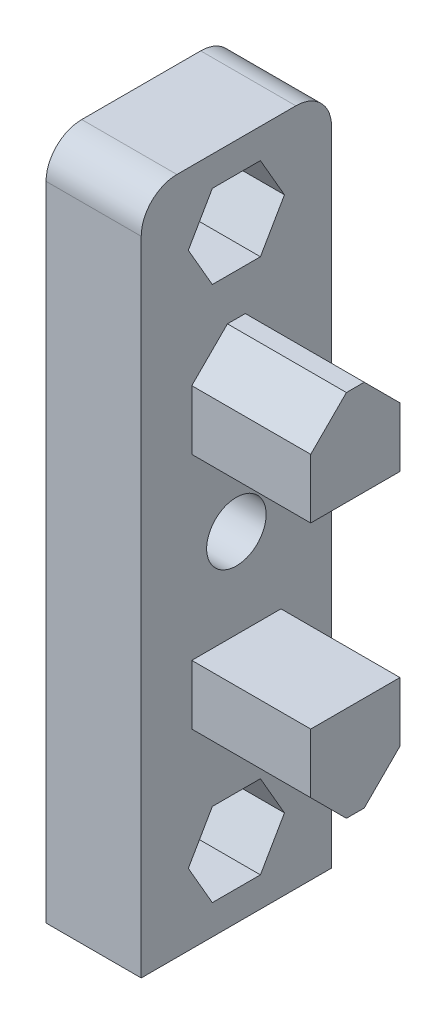
ISO-10303-21;
HEADER;
FILE_DESCRIPTION(('STEP AP214'),'2;1');
FILE_NAME('part.step','',(''),(''),'','','');
FILE_SCHEMA(('AUTOMOTIVE_DESIGN { 1 0 10303 214 1 1 1 1 }'));
ENDSEC;
DATA;
#1=APPLICATION_CONTEXT('core data for automotive mechanical design processes');
#2=APPLICATION_PROTOCOL_DEFINITION('international standard','automotive_design',2000,#1);
#3=PRODUCT_CONTEXT('',#1,'mechanical');
#4=PRODUCT('Part','Part','',(#3));
#5=PRODUCT_RELATED_PRODUCT_CATEGORY('part','',(#4));
#6=PRODUCT_DEFINITION_FORMATION('','',#4);
#7=PRODUCT_DEFINITION_CONTEXT('part definition',#1,'design');
#8=PRODUCT_DEFINITION('design','',#6,#7);
#9=PRODUCT_DEFINITION_SHAPE('','',#8);
#10=(LENGTH_UNIT() NAMED_UNIT(*) SI_UNIT(.MILLI.,.METRE.));
#11=(NAMED_UNIT(*) PLANE_ANGLE_UNIT() SI_UNIT($,.RADIAN.));
#12=(NAMED_UNIT(*) SI_UNIT($,.STERADIAN.) SOLID_ANGLE_UNIT());
#13=UNCERTAINTY_MEASURE_WITH_UNIT(LENGTH_MEASURE(1.E-05),#10,'distance_accuracy_value','');
#14=(GEOMETRIC_REPRESENTATION_CONTEXT(3) GLOBAL_UNCERTAINTY_ASSIGNED_CONTEXT((#13)) GLOBAL_UNIT_ASSIGNED_CONTEXT((#10,
#11,#12)) REPRESENTATION_CONTEXT('',''));
#15=CARTESIAN_POINT('',(0.,0.,0.));
#16=DIRECTION('',(0.,0.,1.));
#17=DIRECTION('',(1.,0.,0.));
#18=AXIS2_PLACEMENT_3D('',#15,#16,#17);
#19=CARTESIAN_POINT('',(8.,0.,0.));
#20=DIRECTION('',(1.,0.,0.));
#21=DIRECTION('',(0.,0.,-1.));
#22=AXIS2_PLACEMENT_3D('',#19,#20,#21);
#23=PLANE('',#22);
#24=CARTESIAN_POINT('',(8.,-14.25,0.));
#25=DIRECTION('',(1.,0.,0.));
#26=DIRECTION('',(0.,0.,-1.));
#27=AXIS2_PLACEMENT_3D('',#24,#25,#26);
#28=CIRCLE('',#27,2.5);
#29=CARTESIAN_POINT('',(8.,-14.25,-2.5));
#30=VERTEX_POINT('',#29);
#31=EDGE_CURVE('E895',#30,#30,#28,.T.);
#32=ORIENTED_EDGE('',*,*,#31,.F.);
#33=EDGE_LOOP('',(#32));
#34=FACE_BOUND('',#33,.T.);
#35=DIRECTION('',(0.,1.,0.));
#36=VECTOR('',#35,1.);
#37=CARTESIAN_POINT('',(8.,14.25,-8.));
#38=LINE('',#37,#36);
#39=CARTESIAN_POINT('',(8.,-42.75,-8.));
#40=VERTEX_POINT('',#39);
#41=CARTESIAN_POINT('',(8.,11.25,-8.));
#42=VERTEX_POINT('',#41);
#43=EDGE_CURVE('E433',#40,#42,#38,.T.);
#44=ORIENTED_EDGE('',*,*,#43,.T.);
#45=CARTESIAN_POINT('',(8.,11.25,-5.));
#46=DIRECTION('',(1.,0.,0.));
#47=DIRECTION('',(0.,0.,-1.));
#48=AXIS2_PLACEMENT_3D('',#45,#46,#47);
#49=CIRCLE('',#48,3.);
#50=CARTESIAN_POINT('',(8.,14.25,-5.));
#51=VERTEX_POINT('',#50);
#52=EDGE_CURVE('E41',#42,#51,#49,.T.);
#53=ORIENTED_EDGE('',*,*,#52,.T.);
#54=DIRECTION('',(0.,0.,1.));
#55=VECTOR('',#54,1.);
#56=CARTESIAN_POINT('',(8.,14.25,8.));
#57=LINE('',#56,#55);
#58=CARTESIAN_POINT('',(8.,14.25,5.));
#59=VERTEX_POINT('',#58);
#60=EDGE_CURVE('E435',#51,#59,#57,.T.);
#61=ORIENTED_EDGE('',*,*,#60,.T.);
#62=CARTESIAN_POINT('',(8.,11.25,5.));
#63=DIRECTION('',(1.,0.,0.));
#64=DIRECTION('',(0.,0.,-1.));
#65=AXIS2_PLACEMENT_3D('',#62,#63,#64);
#66=CIRCLE('',#65,3.);
#67=CARTESIAN_POINT('',(8.,11.25,8.));
#68=VERTEX_POINT('',#67);
#69=EDGE_CURVE('E48',#59,#68,#66,.T.);
#70=ORIENTED_EDGE('',*,*,#69,.T.);
#71=DIRECTION('',(0.,-1.,0.));
#72=VECTOR('',#71,1.);
#73=CARTESIAN_POINT('',(8.,14.25,8.));
#74=LINE('',#73,#72);
#75=CARTESIAN_POINT('',(8.,-42.75,8.));
#76=VERTEX_POINT('',#75);
#77=EDGE_CURVE('E438',#68,#76,#74,.T.);
#78=ORIENTED_EDGE('',*,*,#77,.T.);
#79=DIRECTION('',(0.,0.,1.));
#80=VECTOR('',#79,1.);
#81=CARTESIAN_POINT('',(8.,-42.75,8.));
#82=LINE('',#81,#80);
#83=EDGE_CURVE('E322',#40,#76,#82,.T.);
#84=ORIENTED_EDGE('',*,*,#83,.F.);
#85=EDGE_LOOP('',(#44,#53,#61,#70,#78,#84));
#86=FACE_BOUND('',#85,.T.);
#87=DIRECTION('',(0.,0.866025403784439,-0.5));
#88=VECTOR('',#87,1.);
#89=CARTESIAN_POINT('',(8.,4.74999999999999,-2.02072594216369));
#90=LINE('',#89,#88);
#91=CARTESIAN_POINT('',(8.,4.74999999999999,-2.02072594216369));
#92=VERTEX_POINT('',#91);
#93=CARTESIAN_POINT('',(8.,8.25,-4.04145188432738));
#94=VERTEX_POINT('',#93);
#95=EDGE_CURVE('E382',#92,#94,#90,.T.);
#96=ORIENTED_EDGE('',*,*,#95,.F.);
#97=DIRECTION('',(0.,0.,-1.));
#98=VECTOR('',#97,1.);
#99=CARTESIAN_POINT('',(8.,4.75,2.02072594216369));
#100=LINE('',#99,#98);
#101=CARTESIAN_POINT('',(8.,4.75,2.02072594216369));
#102=VERTEX_POINT('',#101);
#103=EDGE_CURVE('E389',#102,#92,#100,.T.);
#104=ORIENTED_EDGE('',*,*,#103,.F.);
#105=DIRECTION('',(0.,-0.866025403784438,-0.5));
#106=VECTOR('',#105,1.);
#107=CARTESIAN_POINT('',(8.,8.24999999999999,4.04145188432738));
#108=LINE('',#107,#106);
#109=CARTESIAN_POINT('',(8.,8.24999999999999,4.04145188432738));
#110=VERTEX_POINT('',#109);
#111=EDGE_CURVE('E415',#110,#102,#108,.T.);
#112=ORIENTED_EDGE('',*,*,#111,.F.);
#113=DIRECTION('',(0.,-0.866025403784439,0.5));
#114=VECTOR('',#113,1.);
#115=CARTESIAN_POINT('',(8.,11.75,2.02072594216369));
#116=LINE('',#115,#114);
#117=CARTESIAN_POINT('',(8.,11.75,2.02072594216369));
#118=VERTEX_POINT('',#117);
#119=EDGE_CURVE('E412',#118,#110,#116,.T.);
#120=ORIENTED_EDGE('',*,*,#119,.F.);
#121=DIRECTION('',(0.,0.,1.));
#122=VECTOR('',#121,1.);
#123=CARTESIAN_POINT('',(8.,11.75,-2.02072594216369));
#124=LINE('',#123,#122);
#125=CARTESIAN_POINT('',(8.,11.75,-2.02072594216369));
#126=VERTEX_POINT('',#125);
#127=EDGE_CURVE('E409',#126,#118,#124,.T.);
#128=ORIENTED_EDGE('',*,*,#127,.F.);
#129=DIRECTION('',(0.,0.866025403784438,0.5));
#130=VECTOR('',#129,1.);
#131=CARTESIAN_POINT('',(8.,8.25,-4.04145188432738));
#132=LINE('',#131,#130);
#133=EDGE_CURVE('E406',#94,#126,#132,.T.);
#134=ORIENTED_EDGE('',*,*,#133,.F.);
#135=EDGE_LOOP('',(#96,#104,#112,#120,#128,#134));
#136=FACE_BOUND('',#135,.T.);
#137=DIRECTION('',(0.,0.,1.));
#138=VECTOR('',#137,1.);
#139=CARTESIAN_POINT('',(8.,1.24999999999999,3.75));
#140=LINE('',#139,#138);
#141=CARTESIAN_POINT('',(8.,1.24999999999999,-0.750000000000002));
#142=VERTEX_POINT('',#141);
#143=CARTESIAN_POINT('',(8.,1.24999999999999,0.749999999999996));
#144=VERTEX_POINT('',#143);
#145=EDGE_CURVE('E367',#142,#144,#140,.T.);
#146=ORIENTED_EDGE('',*,*,#145,.F.);
#147=DIRECTION('',(0.,0.707106781186549,0.707106781186546));
#148=VECTOR('',#147,1.);
#149=CARTESIAN_POINT('',(8.,1.24999999999999,-0.750000000000002));
#150=LINE('',#149,#148);
#151=CARTESIAN_POINT('',(8.,-1.75000000000002,-3.75));
#152=VERTEX_POINT('',#151);
#153=EDGE_CURVE('E459',#142,#152,#150,.F.);
#154=ORIENTED_EDGE('',*,*,#153,.T.);
#155=DIRECTION('',(0.,1.,0.));
#156=VECTOR('',#155,1.);
#157=CARTESIAN_POINT('',(8.,1.24999999999999,-3.75));
#158=LINE('',#157,#156);
#159=CARTESIAN_POINT('',(8.,-6.75000000000001,-3.75));
#160=VERTEX_POINT('',#159);
#161=EDGE_CURVE('E352',#160,#152,#158,.T.);
#162=ORIENTED_EDGE('',*,*,#161,.F.);
#163=DIRECTION('',(0.,0.,-1.));
#164=VECTOR('',#163,1.);
#165=CARTESIAN_POINT('',(8.,-6.75000000000001,3.75));
#166=LINE('',#165,#164);
#167=CARTESIAN_POINT('',(8.,-6.75000000000001,3.75));
#168=VERTEX_POINT('',#167);
#169=EDGE_CURVE('E357',#168,#160,#166,.T.);
#170=ORIENTED_EDGE('',*,*,#169,.F.);
#171=DIRECTION('',(0.,-1.,0.));
#172=VECTOR('',#171,1.);
#173=CARTESIAN_POINT('',(8.,1.24999999999999,3.75));
#174=LINE('',#173,#172);
#175=CARTESIAN_POINT('',(8.,-1.75,3.75));
#176=VERTEX_POINT('',#175);
#177=EDGE_CURVE('E370',#176,#168,#174,.T.);
#178=ORIENTED_EDGE('',*,*,#177,.F.);
#179=DIRECTION('',(0.,-0.707106781186547,0.707106781186548));
#180=VECTOR('',#179,1.);
#181=CARTESIAN_POINT('',(8.,-1.75,3.75));
#182=LINE('',#181,#180);
#183=EDGE_CURVE('E461',#176,#144,#182,.F.);
#184=ORIENTED_EDGE('',*,*,#183,.T.);
#185=EDGE_LOOP('',(#146,#154,#162,#170,#178,#184));
#186=FACE_BOUND('',#185,.T.);
#187=DIRECTION('',(0.,-0.866025403784439,-0.5));
#188=VECTOR('',#187,1.);
#189=CARTESIAN_POINT('',(8.,-33.25,-2.02072594216369));
#190=LINE('',#189,#188);
#191=CARTESIAN_POINT('',(8.,-33.25,-2.02072594216369));
#192=VERTEX_POINT('',#191);
#193=CARTESIAN_POINT('',(8.,-36.75,-4.04145188432738));
#194=VERTEX_POINT('',#193);
#195=EDGE_CURVE('E276',#192,#194,#190,.T.);
#196=ORIENTED_EDGE('',*,*,#195,.T.);
#197=DIRECTION('',(0.,-0.866025403784438,0.5));
#198=VECTOR('',#197,1.);
#199=CARTESIAN_POINT('',(8.,-36.75,-4.04145188432738));
#200=LINE('',#199,#198);
#201=CARTESIAN_POINT('',(8.,-40.25,-2.02072594216369));
#202=VERTEX_POINT('',#201);
#203=EDGE_CURVE('E296',#194,#202,#200,.T.);
#204=ORIENTED_EDGE('',*,*,#203,.T.);
#205=DIRECTION('',(0.,0.,1.));
#206=VECTOR('',#205,1.);
#207=CARTESIAN_POINT('',(8.,-40.25,-2.02072594216369));
#208=LINE('',#207,#206);
#209=CARTESIAN_POINT('',(8.,-40.25,2.02072594216369));
#210=VERTEX_POINT('',#209);
#211=EDGE_CURVE('E299',#202,#210,#208,.T.);
#212=ORIENTED_EDGE('',*,*,#211,.T.);
#213=DIRECTION('',(0.,0.866025403784439,0.5));
#214=VECTOR('',#213,1.);
#215=CARTESIAN_POINT('',(8.,-40.25,2.02072594216369));
#216=LINE('',#215,#214);
#217=CARTESIAN_POINT('',(8.,-36.75,4.04145188432738));
#218=VERTEX_POINT('',#217);
#219=EDGE_CURVE('E302',#210,#218,#216,.T.);
#220=ORIENTED_EDGE('',*,*,#219,.T.);
#221=DIRECTION('',(0.,0.866025403784438,-0.5));
#222=VECTOR('',#221,1.);
#223=CARTESIAN_POINT('',(8.,-36.75,4.04145188432738));
#224=LINE('',#223,#222);
#225=CARTESIAN_POINT('',(8.,-33.25,2.02072594216369));
#226=VERTEX_POINT('',#225);
#227=EDGE_CURVE('E305',#218,#226,#224,.T.);
#228=ORIENTED_EDGE('',*,*,#227,.T.);
#229=DIRECTION('',(0.,0.,-1.));
#230=VECTOR('',#229,1.);
#231=CARTESIAN_POINT('',(8.,-33.25,2.02072594216369));
#232=LINE('',#231,#230);
#233=EDGE_CURVE('E283',#226,#192,#232,.T.);
#234=ORIENTED_EDGE('',*,*,#233,.T.);
#235=EDGE_LOOP('',(#196,#204,#212,#220,#228,#234));
#236=FACE_BOUND('',#235,.T.);
#237=DIRECTION('',(0.,0.,1.));
#238=VECTOR('',#237,1.);
#239=CARTESIAN_POINT('',(8.,-29.75,3.75));
#240=LINE('',#239,#238);
#241=CARTESIAN_POINT('',(8.,-29.75,-0.750000000000002));
#242=VERTEX_POINT('',#241);
#243=CARTESIAN_POINT('',(8.,-29.75,0.749999999999996));
#244=VERTEX_POINT('',#243);
#245=EDGE_CURVE('E265',#242,#244,#240,.T.);
#246=ORIENTED_EDGE('',*,*,#245,.T.);
#247=DIRECTION('',(0.,0.707106781186547,0.707106781186548));
#248=VECTOR('',#247,1.);
#249=CARTESIAN_POINT('',(8.,-26.75,3.75));
#250=LINE('',#249,#248);
#251=CARTESIAN_POINT('',(8.,-26.75,3.75));
#252=VERTEX_POINT('',#251);
#253=EDGE_CURVE('E349',#252,#244,#250,.F.);
#254=ORIENTED_EDGE('',*,*,#253,.F.);
#255=DIRECTION('',(0.,1.,0.));
#256=VECTOR('',#255,1.);
#257=CARTESIAN_POINT('',(8.,-29.75,3.75));
#258=LINE('',#257,#256);
#259=CARTESIAN_POINT('',(8.,-21.75,3.75));
#260=VERTEX_POINT('',#259);
#261=EDGE_CURVE('E269',#252,#260,#258,.T.);
#262=ORIENTED_EDGE('',*,*,#261,.T.);
#263=DIRECTION('',(0.,0.,-1.));
#264=VECTOR('',#263,1.);
#265=CARTESIAN_POINT('',(8.,-21.75,3.75));
#266=LINE('',#265,#264);
#267=CARTESIAN_POINT('',(8.,-21.75,-3.75));
#268=VERTEX_POINT('',#267);
#269=EDGE_CURVE('E247',#260,#268,#266,.T.);
#270=ORIENTED_EDGE('',*,*,#269,.T.);
#271=DIRECTION('',(0.,-1.,0.));
#272=VECTOR('',#271,1.);
#273=CARTESIAN_POINT('',(8.,-29.75,-3.75));
#274=LINE('',#273,#272);
#275=CARTESIAN_POINT('',(8.,-26.75,-3.75));
#276=VERTEX_POINT('',#275);
#277=EDGE_CURVE('E262',#268,#276,#274,.T.);
#278=ORIENTED_EDGE('',*,*,#277,.T.);
#279=DIRECTION('',(0.,-0.707106781186549,0.707106781186546));
#280=VECTOR('',#279,1.);
#281=CARTESIAN_POINT('',(8.,-29.75,-0.750000000000002));
#282=LINE('',#281,#280);
#283=EDGE_CURVE('E346',#242,#276,#282,.F.);
#284=ORIENTED_EDGE('',*,*,#283,.F.);
#285=EDGE_LOOP('',(#246,#254,#262,#270,#278,#284));
#286=FACE_BOUND('',#285,.T.);
#287=ADVANCED_FACE('F33',(#34,#86,#136,#186,#236,#286),#23,.T.);
#288=CARTESIAN_POINT('',(8.,14.25,-8.));
#289=DIRECTION('',(0.,0.,1.));
#290=DIRECTION('',(0.,-1.,0.));
#291=AXIS2_PLACEMENT_3D('',#288,#289,#290);
#292=PLANE('',#291);
#293=DIRECTION('',(0.,1.,0.));
#294=VECTOR('',#293,1.);
#295=CARTESIAN_POINT('',(0.,14.25,-8.));
#296=LINE('',#295,#294);
#297=CARTESIAN_POINT('',(0.,-42.75,-8.));
#298=VERTEX_POINT('',#297);
#299=CARTESIAN_POINT('',(0.,11.25,-8.));
#300=VERTEX_POINT('',#299);
#301=EDGE_CURVE('E422',#298,#300,#296,.T.);
#302=ORIENTED_EDGE('',*,*,#301,.T.);
#303=DIRECTION('',(-1.,0.,0.));
#304=VECTOR('',#303,1.);
#305=CARTESIAN_POINT('',(8.,11.25,-8.));
#306=LINE('',#305,#304);
#307=EDGE_CURVE('E56',#300,#42,#306,.F.);
#308=ORIENTED_EDGE('',*,*,#307,.T.);
#309=ORIENTED_EDGE('',*,*,#43,.F.);
#310=DIRECTION('',(-1.,0.,0.));
#311=VECTOR('',#310,1.);
#312=CARTESIAN_POINT('',(8.,-42.75,-8.));
#313=LINE('',#312,#311);
#314=EDGE_CURVE('E330',#40,#298,#313,.T.);
#315=ORIENTED_EDGE('',*,*,#314,.T.);
#316=EDGE_LOOP('',(#302,#308,#309,#315));
#317=FACE_BOUND('',#316,.T.);
#318=ADVANCED_FACE('F488',(#317),#292,.F.);
#319=CARTESIAN_POINT('',(8.,14.25,8.));
#320=DIRECTION('',(0.,-1.,0.));
#321=DIRECTION('',(0.,0.,-1.));
#322=AXIS2_PLACEMENT_3D('',#319,#320,#321);
#323=PLANE('',#322);
#324=ORIENTED_EDGE('',*,*,#60,.F.);
#325=DIRECTION('',(-1.,0.,0.));
#326=VECTOR('',#325,1.);
#327=CARTESIAN_POINT('',(8.,14.25,-5.));
#328=LINE('',#327,#326);
#329=CARTESIAN_POINT('',(0.,14.25,-5.));
#330=VERTEX_POINT('',#329);
#331=EDGE_CURVE('E465',#51,#330,#328,.T.);
#332=ORIENTED_EDGE('',*,*,#331,.T.);
#333=DIRECTION('',(0.,0.,1.));
#334=VECTOR('',#333,1.);
#335=CARTESIAN_POINT('',(0.,14.25,8.));
#336=LINE('',#335,#334);
#337=CARTESIAN_POINT('',(0.,14.25,5.));
#338=VERTEX_POINT('',#337);
#339=EDGE_CURVE('E442',#330,#338,#336,.T.);
#340=ORIENTED_EDGE('',*,*,#339,.T.);
#341=DIRECTION('',(-1.,0.,0.));
#342=VECTOR('',#341,1.);
#343=CARTESIAN_POINT('',(8.,14.25,5.));
#344=LINE('',#343,#342);
#345=EDGE_CURVE('E463',#338,#59,#344,.F.);
#346=ORIENTED_EDGE('',*,*,#345,.T.);
#347=EDGE_LOOP('',(#324,#332,#340,#346));
#348=FACE_BOUND('',#347,.T.);
#349=ADVANCED_FACE('F480',(#348),#323,.F.);
#350=CARTESIAN_POINT('',(8.,14.25,8.));
#351=DIRECTION('',(0.,0.,-1.));
#352=DIRECTION('',(0.,1.,0.));
#353=AXIS2_PLACEMENT_3D('',#350,#351,#352);
#354=PLANE('',#353);
#355=ORIENTED_EDGE('',*,*,#77,.F.);
#356=DIRECTION('',(-1.,0.,0.));
#357=VECTOR('',#356,1.);
#358=CARTESIAN_POINT('',(8.,11.25,8.));
#359=LINE('',#358,#357);
#360=CARTESIAN_POINT('',(0.,11.25,8.));
#361=VERTEX_POINT('',#360);
#362=EDGE_CURVE('E11',#68,#361,#359,.T.);
#363=ORIENTED_EDGE('',*,*,#362,.T.);
#364=DIRECTION('',(0.,-1.,0.));
#365=VECTOR('',#364,1.);
#366=CARTESIAN_POINT('',(0.,14.25,8.));
#367=LINE('',#366,#365);
#368=CARTESIAN_POINT('',(0.,-42.75,8.));
#369=VERTEX_POINT('',#368);
#370=EDGE_CURVE('E436',#361,#369,#367,.T.);
#371=ORIENTED_EDGE('',*,*,#370,.T.);
#372=DIRECTION('',(-1.,0.,0.));
#373=VECTOR('',#372,1.);
#374=CARTESIAN_POINT('',(8.,-42.75,8.));
#375=LINE('',#374,#373);
#376=EDGE_CURVE('E325',#76,#369,#375,.T.);
#377=ORIENTED_EDGE('',*,*,#376,.F.);
#378=EDGE_LOOP('',(#355,#363,#371,#377));
#379=FACE_BOUND('',#378,.T.);
#380=ADVANCED_FACE('F495',(#379),#354,.F.);
#381=CARTESIAN_POINT('',(0.,0.,0.));
#382=DIRECTION('',(1.,0.,0.));
#383=DIRECTION('',(0.,0.,-1.));
#384=AXIS2_PLACEMENT_3D('',#381,#382,#383);
#385=PLANE('',#384);
#386=CARTESIAN_POINT('',(0.,-14.25,0.));
#387=DIRECTION('',(1.,0.,0.));
#388=DIRECTION('',(0.,0.,-1.));
#389=AXIS2_PLACEMENT_3D('',#386,#387,#388);
#390=CIRCLE('',#389,2.5);
#391=CARTESIAN_POINT('',(0.,-14.25,-2.5));
#392=VERTEX_POINT('',#391);
#393=EDGE_CURVE('E266',#392,#392,#390,.T.);
#394=ORIENTED_EDGE('',*,*,#393,.T.);
#395=EDGE_LOOP('',(#394));
#396=FACE_BOUND('',#395,.T.);
#397=CARTESIAN_POINT('',(0.,8.25,0.));
#398=DIRECTION('',(1.,0.,0.));
#399=DIRECTION('',(0.,0.,-1.));
#400=AXIS2_PLACEMENT_3D('',#397,#398,#399);
#401=CIRCLE('',#400,2.5);
#402=CARTESIAN_POINT('',(0.,8.25,-2.5));
#403=VERTEX_POINT('',#402);
#404=EDGE_CURVE('E379',#403,#403,#401,.T.);
#405=ORIENTED_EDGE('',*,*,#404,.T.);
#406=EDGE_LOOP('',(#405));
#407=FACE_BOUND('',#406,.T.);
#408=ORIENTED_EDGE('',*,*,#339,.F.);
#409=CARTESIAN_POINT('',(0.,11.25,-5.));
#410=DIRECTION('',(1.,0.,0.));
#411=DIRECTION('',(0.,0.,-1.));
#412=AXIS2_PLACEMENT_3D('',#409,#410,#411);
#413=CIRCLE('',#412,3.);
#414=EDGE_CURVE('E470',#330,#300,#413,.F.);
#415=ORIENTED_EDGE('',*,*,#414,.T.);
#416=ORIENTED_EDGE('',*,*,#301,.F.);
#417=DIRECTION('',(0.,0.,1.));
#418=VECTOR('',#417,1.);
#419=CARTESIAN_POINT('',(0.,-42.75,8.));
#420=LINE('',#419,#418);
#421=EDGE_CURVE('E312',#298,#369,#420,.T.);
#422=ORIENTED_EDGE('',*,*,#421,.T.);
#423=ORIENTED_EDGE('',*,*,#370,.F.);
#424=CARTESIAN_POINT('',(0.,11.25,5.));
#425=DIRECTION('',(1.,0.,0.));
#426=DIRECTION('',(0.,0.,-1.));
#427=AXIS2_PLACEMENT_3D('',#424,#425,#426);
#428=CIRCLE('',#427,3.);
#429=EDGE_CURVE('E468',#361,#338,#428,.F.);
#430=ORIENTED_EDGE('',*,*,#429,.T.);
#431=EDGE_LOOP('',(#408,#415,#416,#422,#423,#430));
#432=FACE_BOUND('',#431,.T.);
#433=CARTESIAN_POINT('',(0.,-36.75,0.));
#434=DIRECTION('',(-1.,0.,0.));
#435=DIRECTION('',(0.,0.,-1.));
#436=AXIS2_PLACEMENT_3D('',#433,#434,#435);
#437=CIRCLE('',#436,2.5);
#438=CARTESIAN_POINT('',(0.,-36.75,-2.5));
#439=VERTEX_POINT('',#438);
#440=EDGE_CURVE('E273',#439,#439,#437,.T.);
#441=ORIENTED_EDGE('',*,*,#440,.F.);
#442=EDGE_LOOP('',(#441));
#443=FACE_BOUND('',#442,.T.);
#444=ADVANCED_FACE('F485',(#396,#407,#432,#443),#385,.F.);
#445=CARTESIAN_POINT('',(2.5,4.74999999999999,-2.02072594216369));
#446=DIRECTION('',(0.,-0.5,-0.866025403784439));
#447=DIRECTION('',(0.,0.866025403784439,-0.5));
#448=AXIS2_PLACEMENT_3D('',#445,#446,#447);
#449=PLANE('',#448);
#450=ORIENTED_EDGE('',*,*,#95,.T.);
#451=DIRECTION('',(1.,0.,0.));
#452=VECTOR('',#451,1.);
#453=CARTESIAN_POINT('',(2.5,8.25,-4.04145188432738));
#454=LINE('',#453,#452);
#455=CARTESIAN_POINT('',(2.5,8.25,-4.04145188432738));
#456=VERTEX_POINT('',#455);
#457=EDGE_CURVE('E404',#456,#94,#454,.T.);
#458=ORIENTED_EDGE('',*,*,#457,.F.);
#459=DIRECTION('',(0.,0.866025403784439,-0.5));
#460=VECTOR('',#459,1.);
#461=CARTESIAN_POINT('',(2.5,4.74999999999999,-2.02072594216369));
#462=LINE('',#461,#460);
#463=CARTESIAN_POINT('',(2.5,4.74999999999999,-2.02072594216369));
#464=VERTEX_POINT('',#463);
#465=EDGE_CURVE('E385',#464,#456,#462,.T.);
#466=ORIENTED_EDGE('',*,*,#465,.F.);
#467=DIRECTION('',(1.,0.,0.));
#468=VECTOR('',#467,1.);
#469=CARTESIAN_POINT('',(2.5,4.74999999999999,-2.02072594216369));
#470=LINE('',#469,#468);
#471=EDGE_CURVE('E420',#464,#92,#470,.T.);
#472=ORIENTED_EDGE('',*,*,#471,.T.);
#473=EDGE_LOOP('',(#450,#458,#466,#472));
#474=FACE_BOUND('',#473,.T.);
#475=ADVANCED_FACE('F513',(#474),#449,.F.);
#476=CARTESIAN_POINT('',(2.5,4.75,2.02072594216369));
#477=DIRECTION('',(0.,-1.,0.));
#478=DIRECTION('',(0.,0.,-1.));
#479=AXIS2_PLACEMENT_3D('',#476,#477,#478);
#480=PLANE('',#479);
#481=ORIENTED_EDGE('',*,*,#103,.T.);
#482=ORIENTED_EDGE('',*,*,#471,.F.);
#483=DIRECTION('',(0.,0.,-1.));
#484=VECTOR('',#483,1.);
#485=CARTESIAN_POINT('',(2.5,4.75,2.02072594216369));
#486=LINE('',#485,#484);
#487=CARTESIAN_POINT('',(2.5,4.75,2.02072594216369));
#488=VERTEX_POINT('',#487);
#489=EDGE_CURVE('E401',#488,#464,#486,.T.);
#490=ORIENTED_EDGE('',*,*,#489,.F.);
#491=DIRECTION('',(1.,0.,0.));
#492=VECTOR('',#491,1.);
#493=CARTESIAN_POINT('',(2.5,4.75,2.02072594216369));
#494=LINE('',#493,#492);
#495=EDGE_CURVE('E423',#488,#102,#494,.T.);
#496=ORIENTED_EDGE('',*,*,#495,.T.);
#497=EDGE_LOOP('',(#481,#482,#490,#496));
#498=FACE_BOUND('',#497,.T.);
#499=ADVANCED_FACE('F579',(#498),#480,.F.);
#500=CARTESIAN_POINT('',(2.5,8.24999999999999,4.04145188432738));
#501=DIRECTION('',(0.,-0.5,0.866025403784439));
#502=DIRECTION('',(0.,-0.866025403784439,-0.5));
#503=AXIS2_PLACEMENT_3D('',#500,#501,#502);
#504=PLANE('',#503);
#505=ORIENTED_EDGE('',*,*,#111,.T.);
#506=ORIENTED_EDGE('',*,*,#495,.F.);
#507=DIRECTION('',(0.,-0.866025403784438,-0.5));
#508=VECTOR('',#507,1.);
#509=CARTESIAN_POINT('',(2.5,8.24999999999999,4.04145188432738));
#510=LINE('',#509,#508);
#511=CARTESIAN_POINT('',(2.5,8.24999999999999,4.04145188432738));
#512=VERTEX_POINT('',#511);
#513=EDGE_CURVE('E398',#512,#488,#510,.T.);
#514=ORIENTED_EDGE('',*,*,#513,.F.);
#515=DIRECTION('',(1.,0.,0.));
#516=VECTOR('',#515,1.);
#517=CARTESIAN_POINT('',(2.5,8.24999999999999,4.04145188432738));
#518=LINE('',#517,#516);
#519=EDGE_CURVE('E425',#512,#110,#518,.T.);
#520=ORIENTED_EDGE('',*,*,#519,.T.);
#521=EDGE_LOOP('',(#505,#506,#514,#520));
#522=FACE_BOUND('',#521,.T.);
#523=ADVANCED_FACE('F582',(#522),#504,.F.);
#524=CARTESIAN_POINT('',(2.5,11.75,2.02072594216369));
#525=DIRECTION('',(0.,0.5,0.866025403784439));
#526=DIRECTION('',(0.,-0.866025403784439,0.5));
#527=AXIS2_PLACEMENT_3D('',#524,#525,#526);
#528=PLANE('',#527);
#529=ORIENTED_EDGE('',*,*,#119,.T.);
#530=ORIENTED_EDGE('',*,*,#519,.F.);
#531=DIRECTION('',(0.,-0.866025403784439,0.5));
#532=VECTOR('',#531,1.);
#533=CARTESIAN_POINT('',(2.5,11.75,2.02072594216369));
#534=LINE('',#533,#532);
#535=CARTESIAN_POINT('',(2.5,11.75,2.02072594216369));
#536=VERTEX_POINT('',#535);
#537=EDGE_CURVE('E395',#536,#512,#534,.T.);
#538=ORIENTED_EDGE('',*,*,#537,.F.);
#539=DIRECTION('',(1.,0.,0.));
#540=VECTOR('',#539,1.);
#541=CARTESIAN_POINT('',(2.5,11.75,2.02072594216369));
#542=LINE('',#541,#540);
#543=EDGE_CURVE('E427',#536,#118,#542,.T.);
#544=ORIENTED_EDGE('',*,*,#543,.T.);
#545=EDGE_LOOP('',(#529,#530,#538,#544));
#546=FACE_BOUND('',#545,.T.);
#547=ADVANCED_FACE('F586',(#546),#528,.F.);
#548=CARTESIAN_POINT('',(2.5,11.75,-2.02072594216369));
#549=DIRECTION('',(0.,1.,0.));
#550=DIRECTION('',(0.,0.,1.));
#551=AXIS2_PLACEMENT_3D('',#548,#549,#550);
#552=PLANE('',#551);
#553=ORIENTED_EDGE('',*,*,#127,.T.);
#554=ORIENTED_EDGE('',*,*,#543,.F.);
#555=DIRECTION('',(0.,0.,1.));
#556=VECTOR('',#555,1.);
#557=CARTESIAN_POINT('',(2.5,11.75,-2.02072594216369));
#558=LINE('',#557,#556);
#559=CARTESIAN_POINT('',(2.5,11.75,-2.02072594216369));
#560=VERTEX_POINT('',#559);
#561=EDGE_CURVE('E392',#560,#536,#558,.T.);
#562=ORIENTED_EDGE('',*,*,#561,.F.);
#563=DIRECTION('',(1.,0.,0.));
#564=VECTOR('',#563,1.);
#565=CARTESIAN_POINT('',(2.5,11.75,-2.02072594216369));
#566=LINE('',#565,#564);
#567=EDGE_CURVE('E429',#560,#126,#566,.T.);
#568=ORIENTED_EDGE('',*,*,#567,.T.);
#569=EDGE_LOOP('',(#553,#554,#562,#568));
#570=FACE_BOUND('',#569,.T.);
#571=ADVANCED_FACE('F590',(#570),#552,.F.);
#572=CARTESIAN_POINT('',(2.5,8.25,-4.04145188432738));
#573=DIRECTION('',(0.,0.5,-0.866025403784439));
#574=DIRECTION('',(0.,0.866025403784439,0.5));
#575=AXIS2_PLACEMENT_3D('',#572,#573,#574);
#576=PLANE('',#575);
#577=ORIENTED_EDGE('',*,*,#133,.T.);
#578=ORIENTED_EDGE('',*,*,#567,.F.);
#579=DIRECTION('',(0.,0.866025403784438,0.5));
#580=VECTOR('',#579,1.);
#581=CARTESIAN_POINT('',(2.5,8.25,-4.04145188432738));
#582=LINE('',#581,#580);
#583=EDGE_CURVE('E388',#456,#560,#582,.T.);
#584=ORIENTED_EDGE('',*,*,#583,.F.);
#585=ORIENTED_EDGE('',*,*,#457,.T.);
#586=EDGE_LOOP('',(#577,#578,#584,#585));
#587=FACE_BOUND('',#586,.T.);
#588=ADVANCED_FACE('F577',(#587),#576,.F.);
#589=CARTESIAN_POINT('',(2.5,0.,0.));
#590=DIRECTION('',(1.,0.,0.));
#591=DIRECTION('',(0.,0.,-1.));
#592=AXIS2_PLACEMENT_3D('',#589,#590,#591);
#593=PLANE('',#592);
#594=CARTESIAN_POINT('',(2.5,8.25,0.));
#595=DIRECTION('',(1.,0.,0.));
#596=DIRECTION('',(0.,0.,-1.));
#597=AXIS2_PLACEMENT_3D('',#594,#595,#596);
#598=CIRCLE('',#597,2.5);
#599=CARTESIAN_POINT('',(2.5,8.25,-2.5));
#600=VERTEX_POINT('',#599);
#601=EDGE_CURVE('E378',#600,#600,#598,.T.);
#602=ORIENTED_EDGE('',*,*,#601,.F.);
#603=EDGE_LOOP('',(#602));
#604=FACE_BOUND('',#603,.T.);
#605=ORIENTED_EDGE('',*,*,#465,.T.);
#606=ORIENTED_EDGE('',*,*,#583,.T.);
#607=ORIENTED_EDGE('',*,*,#561,.T.);
#608=ORIENTED_EDGE('',*,*,#537,.T.);
#609=ORIENTED_EDGE('',*,*,#513,.T.);
#610=ORIENTED_EDGE('',*,*,#489,.T.);
#611=EDGE_LOOP('',(#605,#606,#607,#608,#609,#610));
#612=FACE_BOUND('',#611,.T.);
#613=ADVANCED_FACE('F570',(#604,#612),#593,.T.);
#614=CARTESIAN_POINT('',(0.,8.25,0.));
#615=DIRECTION('',(1.,0.,0.));
#616=DIRECTION('',(0.,0.,-1.));
#617=AXIS2_PLACEMENT_3D('',#614,#615,#616);
#618=CYLINDRICAL_SURFACE('',#617,2.5);
#619=ORIENTED_EDGE('',*,*,#404,.F.);
#620=EDGE_LOOP('',(#619));
#621=FACE_BOUND('',#620,.T.);
#622=ORIENTED_EDGE('',*,*,#601,.T.);
#623=EDGE_LOOP('',(#622));
#624=FACE_BOUND('',#623,.T.);
#625=ADVANCED_FACE('F563',(#621,#624),#618,.F.);
#626=CARTESIAN_POINT('',(18.,1.24999999999999,-3.75));
#627=DIRECTION('',(0.,0.,1.));
#628=DIRECTION('',(0.,-1.,0.));
#629=AXIS2_PLACEMENT_3D('',#626,#627,#628);
#630=PLANE('',#629);
#631=ORIENTED_EDGE('',*,*,#161,.T.);
#632=DIRECTION('',(1.,0.,0.));
#633=VECTOR('',#632,1.);
#634=CARTESIAN_POINT('',(18.,-1.75000000000002,-3.75));
#635=LINE('',#634,#633);
#636=CARTESIAN_POINT('',(18.,-1.75000000000002,-3.75));
#637=VERTEX_POINT('',#636);
#638=EDGE_CURVE('E450',#152,#637,#635,.T.);
#639=ORIENTED_EDGE('',*,*,#638,.T.);
#640=DIRECTION('',(0.,1.,0.));
#641=VECTOR('',#640,1.);
#642=CARTESIAN_POINT('',(18.,1.24999999999999,-3.75));
#643=LINE('',#642,#641);
#644=CARTESIAN_POINT('',(18.,-6.75000000000001,-3.75));
#645=VERTEX_POINT('',#644);
#646=EDGE_CURVE('E353',#645,#637,#643,.T.);
#647=ORIENTED_EDGE('',*,*,#646,.F.);
#648=DIRECTION('',(-1.,0.,0.));
#649=VECTOR('',#648,1.);
#650=CARTESIAN_POINT('',(18.,-6.75000000000001,-3.75));
#651=LINE('',#650,#649);
#652=EDGE_CURVE('E364',#645,#160,#651,.T.);
#653=ORIENTED_EDGE('',*,*,#652,.T.);
#654=EDGE_LOOP('',(#631,#639,#647,#653));
#655=FACE_BOUND('',#654,.T.);
#656=ADVANCED_FACE('F561',(#655),#630,.F.);
#657=CARTESIAN_POINT('',(18.,1.24999999999999,3.75));
#658=DIRECTION('',(0.,-1.,0.));
#659=DIRECTION('',(0.,0.,-1.));
#660=AXIS2_PLACEMENT_3D('',#657,#658,#659);
#661=PLANE('',#660);
#662=DIRECTION('',(0.,0.,1.));
#663=VECTOR('',#662,1.);
#664=CARTESIAN_POINT('',(18.,1.24999999999999,3.75));
#665=LINE('',#664,#663);
#666=CARTESIAN_POINT('',(18.,1.24999999999999,-0.750000000000001));
#667=VERTEX_POINT('',#666);
#668=CARTESIAN_POINT('',(18.,1.24999999999999,0.749999999999996));
#669=VERTEX_POINT('',#668);
#670=EDGE_CURVE('E356',#667,#669,#665,.T.);
#671=ORIENTED_EDGE('',*,*,#670,.F.);
#672=DIRECTION('',(-1.,0.,0.));
#673=VECTOR('',#672,1.);
#674=CARTESIAN_POINT('',(18.,1.24999999999999,-0.750000000000002));
#675=LINE('',#674,#673);
#676=EDGE_CURVE('E447',#667,#142,#675,.T.);
#677=ORIENTED_EDGE('',*,*,#676,.T.);
#678=ORIENTED_EDGE('',*,*,#145,.T.);
#679=DIRECTION('',(1.,0.,0.));
#680=VECTOR('',#679,1.);
#681=CARTESIAN_POINT('',(18.,1.24999999999999,0.749999999999996));
#682=LINE('',#681,#680);
#683=EDGE_CURVE('E440',#144,#669,#682,.T.);
#684=ORIENTED_EDGE('',*,*,#683,.T.);
#685=EDGE_LOOP('',(#671,#677,#678,#684));
#686=FACE_BOUND('',#685,.T.);
#687=ADVANCED_FACE('F557',(#686),#661,.F.);
#688=CARTESIAN_POINT('',(18.,1.24999999999999,3.75));
#689=DIRECTION('',(0.,0.,-1.));
#690=DIRECTION('',(0.,1.,0.));
#691=AXIS2_PLACEMENT_3D('',#688,#689,#690);
#692=PLANE('',#691);
#693=DIRECTION('',(0.,-1.,0.));
#694=VECTOR('',#693,1.);
#695=CARTESIAN_POINT('',(18.,1.24999999999999,3.75));
#696=LINE('',#695,#694);
#697=CARTESIAN_POINT('',(18.,-1.75,3.75));
#698=VERTEX_POINT('',#697);
#699=CARTESIAN_POINT('',(18.,-6.75000000000001,3.75));
#700=VERTEX_POINT('',#699);
#701=EDGE_CURVE('E360',#698,#700,#696,.T.);
#702=ORIENTED_EDGE('',*,*,#701,.F.);
#703=DIRECTION('',(-1.,0.,0.));
#704=VECTOR('',#703,1.);
#705=CARTESIAN_POINT('',(18.,-1.75,3.75));
#706=LINE('',#705,#704);
#707=EDGE_CURVE('E456',#698,#176,#706,.T.);
#708=ORIENTED_EDGE('',*,*,#707,.T.);
#709=ORIENTED_EDGE('',*,*,#177,.T.);
#710=DIRECTION('',(-1.,0.,0.));
#711=VECTOR('',#710,1.);
#712=CARTESIAN_POINT('',(18.,-6.75000000000001,3.75));
#713=LINE('',#712,#711);
#714=EDGE_CURVE('E375',#700,#168,#713,.T.);
#715=ORIENTED_EDGE('',*,*,#714,.F.);
#716=EDGE_LOOP('',(#702,#708,#709,#715));
#717=FACE_BOUND('',#716,.T.);
#718=ADVANCED_FACE('F543',(#717),#692,.F.);
#719=CARTESIAN_POINT('',(18.,-6.75000000000001,3.75));
#720=DIRECTION('',(0.,1.,0.));
#721=DIRECTION('',(0.,0.,1.));
#722=AXIS2_PLACEMENT_3D('',#719,#720,#721);
#723=PLANE('',#722);
#724=ORIENTED_EDGE('',*,*,#169,.T.);
#725=ORIENTED_EDGE('',*,*,#652,.F.);
#726=DIRECTION('',(0.,0.,-1.));
#727=VECTOR('',#726,1.);
#728=CARTESIAN_POINT('',(18.,-6.75000000000001,3.75));
#729=LINE('',#728,#727);
#730=EDGE_CURVE('E362',#700,#645,#729,.T.);
#731=ORIENTED_EDGE('',*,*,#730,.F.);
#732=ORIENTED_EDGE('',*,*,#714,.T.);
#733=EDGE_LOOP('',(#724,#725,#731,#732));
#734=FACE_BOUND('',#733,.T.);
#735=ADVANCED_FACE('F549',(#734),#723,.F.);
#736=CARTESIAN_POINT('',(18.,0.,0.));
#737=DIRECTION('',(1.,0.,0.));
#738=DIRECTION('',(0.,0.,-1.));
#739=AXIS2_PLACEMENT_3D('',#736,#737,#738);
#740=PLANE('',#739);
#741=ORIENTED_EDGE('',*,*,#646,.T.);
#742=DIRECTION('',(0.,-0.707106781186549,-0.707106781186546));
#743=VECTOR('',#742,1.);
#744=CARTESIAN_POINT('',(18.,0.999999999999996,-0.999999999999999));
#745=LINE('',#744,#743);
#746=EDGE_CURVE('E454',#637,#667,#745,.F.);
#747=ORIENTED_EDGE('',*,*,#746,.T.);
#748=ORIENTED_EDGE('',*,*,#670,.T.);
#749=DIRECTION('',(0.,0.707106781186547,-0.707106781186548));
#750=VECTOR('',#749,1.);
#751=CARTESIAN_POINT('',(18.,0.999999999999997,0.999999999999994));
#752=LINE('',#751,#750);
#753=EDGE_CURVE('E452',#669,#698,#752,.F.);
#754=ORIENTED_EDGE('',*,*,#753,.T.);
#755=ORIENTED_EDGE('',*,*,#701,.T.);
#756=ORIENTED_EDGE('',*,*,#730,.T.);
#757=EDGE_LOOP('',(#741,#747,#748,#754,#755,#756));
#758=FACE_BOUND('',#757,.T.);
#759=ADVANCED_FACE('F526',(#758),#740,.T.);
#760=CARTESIAN_POINT('',(18.,1.24999999999999,-0.750000000000002));
#761=DIRECTION('',(0.,-0.707106781186546,0.707106781186549));
#762=DIRECTION('',(-1.,0.,0.));
#763=AXIS2_PLACEMENT_3D('',#760,#761,#762);
#764=PLANE('',#763);
#765=ORIENTED_EDGE('',*,*,#746,.F.);
#766=ORIENTED_EDGE('',*,*,#638,.F.);
#767=ORIENTED_EDGE('',*,*,#153,.F.);
#768=ORIENTED_EDGE('',*,*,#676,.F.);
#769=EDGE_LOOP('',(#765,#766,#767,#768));
#770=FACE_BOUND('',#769,.T.);
#771=ADVANCED_FACE('F522',(#770),#764,.F.);
#772=CARTESIAN_POINT('',(18.,-1.75,3.75));
#773=DIRECTION('',(0.,-0.707106781186548,-0.707106781186547));
#774=DIRECTION('',(-1.,0.,0.));
#775=AXIS2_PLACEMENT_3D('',#772,#773,#774);
#776=PLANE('',#775);
#777=ORIENTED_EDGE('',*,*,#753,.F.);
#778=ORIENTED_EDGE('',*,*,#683,.F.);
#779=ORIENTED_EDGE('',*,*,#183,.F.);
#780=ORIENTED_EDGE('',*,*,#707,.F.);
#781=EDGE_LOOP('',(#777,#778,#779,#780));
#782=FACE_BOUND('',#781,.T.);
#783=ADVANCED_FACE('F525',(#782),#776,.F.);
#784=CARTESIAN_POINT('',(8.,-42.75,8.));
#785=DIRECTION('',(0.,1.,0.));
#786=DIRECTION('',(0.,0.,-1.));
#787=AXIS2_PLACEMENT_3D('',#784,#785,#786);
#788=PLANE('',#787);
#789=ORIENTED_EDGE('',*,*,#421,.F.);
#790=ORIENTED_EDGE('',*,*,#314,.F.);
#791=ORIENTED_EDGE('',*,*,#83,.T.);
#792=ORIENTED_EDGE('',*,*,#376,.T.);
#793=EDGE_LOOP('',(#789,#790,#791,#792));
#794=FACE_BOUND('',#793,.T.);
#795=ADVANCED_FACE('F491',(#794),#788,.F.);
#796=CARTESIAN_POINT('',(2.5,-33.25,-2.02072594216369));
#797=DIRECTION('',(0.,0.5,-0.866025403784439));
#798=DIRECTION('',(0.,-0.866025403784439,-0.5));
#799=AXIS2_PLACEMENT_3D('',#796,#797,#798);
#800=PLANE('',#799);
#801=ORIENTED_EDGE('',*,*,#195,.F.);
#802=DIRECTION('',(1.,0.,0.));
#803=VECTOR('',#802,1.);
#804=CARTESIAN_POINT('',(2.5,-33.25,-2.02072594216369));
#805=LINE('',#804,#803);
#806=CARTESIAN_POINT('',(2.5,-33.25,-2.02072594216369));
#807=VERTEX_POINT('',#806);
#808=EDGE_CURVE('E310',#807,#192,#805,.T.);
#809=ORIENTED_EDGE('',*,*,#808,.F.);
#810=DIRECTION('',(0.,-0.866025403784439,-0.5));
#811=VECTOR('',#810,1.);
#812=CARTESIAN_POINT('',(2.5,-33.25,-2.02072594216369));
#813=LINE('',#812,#811);
#814=CARTESIAN_POINT('',(2.5,-36.75,-4.04145188432738));
#815=VERTEX_POINT('',#814);
#816=EDGE_CURVE('E279',#807,#815,#813,.T.);
#817=ORIENTED_EDGE('',*,*,#816,.T.);
#818=DIRECTION('',(1.,0.,0.));
#819=VECTOR('',#818,1.);
#820=CARTESIAN_POINT('',(2.5,-36.75,-4.04145188432738));
#821=LINE('',#820,#819);
#822=EDGE_CURVE('E293',#815,#194,#821,.T.);
#823=ORIENTED_EDGE('',*,*,#822,.T.);
#824=EDGE_LOOP('',(#801,#809,#817,#823));
#825=FACE_BOUND('',#824,.T.);
#826=ADVANCED_FACE('F533',(#825),#800,.F.);
#827=CARTESIAN_POINT('',(2.5,-33.25,2.02072594216369));
#828=DIRECTION('',(0.,1.,0.));
#829=DIRECTION('',(0.,0.,-1.));
#830=AXIS2_PLACEMENT_3D('',#827,#828,#829);
#831=PLANE('',#830);
#832=ORIENTED_EDGE('',*,*,#233,.F.);
#833=DIRECTION('',(1.,0.,0.));
#834=VECTOR('',#833,1.);
#835=CARTESIAN_POINT('',(2.5,-33.25,2.02072594216369));
#836=LINE('',#835,#834);
#837=CARTESIAN_POINT('',(2.5,-33.25,2.02072594216369));
#838=VERTEX_POINT('',#837);
#839=EDGE_CURVE('E313',#838,#226,#836,.T.);
#840=ORIENTED_EDGE('',*,*,#839,.F.);
#841=DIRECTION('',(0.,0.,-1.));
#842=VECTOR('',#841,1.);
#843=CARTESIAN_POINT('',(2.5,-33.25,2.02072594216369));
#844=LINE('',#843,#842);
#845=EDGE_CURVE('E291',#838,#807,#844,.T.);
#846=ORIENTED_EDGE('',*,*,#845,.T.);
#847=ORIENTED_EDGE('',*,*,#808,.T.);
#848=EDGE_LOOP('',(#832,#840,#846,#847));
#849=FACE_BOUND('',#848,.T.);
#850=ADVANCED_FACE('F736',(#849),#831,.F.);
#851=CARTESIAN_POINT('',(2.5,-36.75,4.04145188432738));
#852=DIRECTION('',(0.,0.5,0.866025403784439));
#853=DIRECTION('',(0.,0.866025403784439,-0.5));
#854=AXIS2_PLACEMENT_3D('',#851,#852,#853);
#855=PLANE('',#854);
#856=ORIENTED_EDGE('',*,*,#227,.F.);
#857=DIRECTION('',(1.,0.,0.));
#858=VECTOR('',#857,1.);
#859=CARTESIAN_POINT('',(2.5,-36.75,4.04145188432738));
#860=LINE('',#859,#858);
#861=CARTESIAN_POINT('',(2.5,-36.75,4.04145188432738));
#862=VERTEX_POINT('',#861);
#863=EDGE_CURVE('E315',#862,#218,#860,.T.);
#864=ORIENTED_EDGE('',*,*,#863,.F.);
#865=DIRECTION('',(0.,0.866025403784438,-0.5));
#866=VECTOR('',#865,1.);
#867=CARTESIAN_POINT('',(2.5,-36.75,4.04145188432738));
#868=LINE('',#867,#866);
#869=EDGE_CURVE('E289',#862,#838,#868,.T.);
#870=ORIENTED_EDGE('',*,*,#869,.T.);
#871=ORIENTED_EDGE('',*,*,#839,.T.);
#872=EDGE_LOOP('',(#856,#864,#870,#871));
#873=FACE_BOUND('',#872,.T.);
#874=ADVANCED_FACE('F745',(#873),#855,.F.);
#875=CARTESIAN_POINT('',(2.5,-40.25,2.02072594216369));
#876=DIRECTION('',(0.,-0.5,0.866025403784439));
#877=DIRECTION('',(0.,0.866025403784439,0.5));
#878=AXIS2_PLACEMENT_3D('',#875,#876,#877);
#879=PLANE('',#878);
#880=ORIENTED_EDGE('',*,*,#219,.F.);
#881=DIRECTION('',(1.,0.,0.));
#882=VECTOR('',#881,1.);
#883=CARTESIAN_POINT('',(2.5,-40.25,2.02072594216369));
#884=LINE('',#883,#882);
#885=CARTESIAN_POINT('',(2.5,-40.25,2.02072594216369));
#886=VERTEX_POINT('',#885);
#887=EDGE_CURVE('E317',#886,#210,#884,.T.);
#888=ORIENTED_EDGE('',*,*,#887,.F.);
#889=DIRECTION('',(0.,0.866025403784439,0.5));
#890=VECTOR('',#889,1.);
#891=CARTESIAN_POINT('',(2.5,-40.25,2.02072594216369));
#892=LINE('',#891,#890);
#893=EDGE_CURVE('E287',#886,#862,#892,.T.);
#894=ORIENTED_EDGE('',*,*,#893,.T.);
#895=ORIENTED_EDGE('',*,*,#863,.T.);
#896=EDGE_LOOP('',(#880,#888,#894,#895));
#897=FACE_BOUND('',#896,.T.);
#898=ADVANCED_FACE('F754',(#897),#879,.F.);
#899=CARTESIAN_POINT('',(2.5,-40.25,-2.02072594216369));
#900=DIRECTION('',(0.,-1.,0.));
#901=DIRECTION('',(0.,0.,1.));
#902=AXIS2_PLACEMENT_3D('',#899,#900,#901);
#903=PLANE('',#902);
#904=ORIENTED_EDGE('',*,*,#211,.F.);
#905=DIRECTION('',(1.,0.,0.));
#906=VECTOR('',#905,1.);
#907=CARTESIAN_POINT('',(2.5,-40.25,-2.02072594216369));
#908=LINE('',#907,#906);
#909=CARTESIAN_POINT('',(2.5,-40.25,-2.02072594216369));
#910=VERTEX_POINT('',#909);
#911=EDGE_CURVE('E319',#910,#202,#908,.T.);
#912=ORIENTED_EDGE('',*,*,#911,.F.);
#913=DIRECTION('',(0.,0.,1.));
#914=VECTOR('',#913,1.);
#915=CARTESIAN_POINT('',(2.5,-40.25,-2.02072594216369));
#916=LINE('',#915,#914);
#917=EDGE_CURVE('E285',#910,#886,#916,.T.);
#918=ORIENTED_EDGE('',*,*,#917,.T.);
#919=ORIENTED_EDGE('',*,*,#887,.T.);
#920=EDGE_LOOP('',(#904,#912,#918,#919));
#921=FACE_BOUND('',#920,.T.);
#922=ADVANCED_FACE('F763',(#921),#903,.F.);
#923=CARTESIAN_POINT('',(2.5,-36.75,-4.04145188432738));
#924=DIRECTION('',(0.,-0.5,-0.866025403784439));
#925=DIRECTION('',(0.,-0.866025403784439,0.5));
#926=AXIS2_PLACEMENT_3D('',#923,#924,#925);
#927=PLANE('',#926);
#928=ORIENTED_EDGE('',*,*,#203,.F.);
#929=ORIENTED_EDGE('',*,*,#822,.F.);
#930=DIRECTION('',(0.,-0.866025403784438,0.5));
#931=VECTOR('',#930,1.);
#932=CARTESIAN_POINT('',(2.5,-36.75,-4.04145188432738));
#933=LINE('',#932,#931);
#934=EDGE_CURVE('E282',#815,#910,#933,.T.);
#935=ORIENTED_EDGE('',*,*,#934,.T.);
#936=ORIENTED_EDGE('',*,*,#911,.T.);
#937=EDGE_LOOP('',(#928,#929,#935,#936));
#938=FACE_BOUND('',#937,.T.);
#939=ADVANCED_FACE('F772',(#938),#927,.F.);
#940=CARTESIAN_POINT('',(2.5,-28.5,0.));
#941=DIRECTION('',(1.,0.,0.));
#942=DIRECTION('',(0.,0.,-1.));
#943=AXIS2_PLACEMENT_3D('',#940,#941,#942);
#944=PLANE('',#943);
#945=CARTESIAN_POINT('',(2.5,-36.75,0.));
#946=DIRECTION('',(-1.,0.,0.));
#947=DIRECTION('',(0.,0.,-1.));
#948=AXIS2_PLACEMENT_3D('',#945,#946,#947);
#949=CIRCLE('',#948,2.5);
#950=CARTESIAN_POINT('',(2.5,-36.75,-2.5));
#951=VERTEX_POINT('',#950);
#952=EDGE_CURVE('E251',#951,#951,#949,.T.);
#953=ORIENTED_EDGE('',*,*,#952,.T.);
#954=EDGE_LOOP('',(#953));
#955=FACE_BOUND('',#954,.T.);
#956=ORIENTED_EDGE('',*,*,#816,.F.);
#957=ORIENTED_EDGE('',*,*,#845,.F.);
#958=ORIENTED_EDGE('',*,*,#869,.F.);
#959=ORIENTED_EDGE('',*,*,#893,.F.);
#960=ORIENTED_EDGE('',*,*,#917,.F.);
#961=ORIENTED_EDGE('',*,*,#934,.F.);
#962=EDGE_LOOP('',(#956,#957,#958,#959,#960,#961));
#963=FACE_BOUND('',#962,.T.);
#964=ADVANCED_FACE('F781',(#955,#963),#944,.T.);
#965=CARTESIAN_POINT('',(0.,-36.75,0.));
#966=DIRECTION('',(1.,0.,0.));
#967=DIRECTION('',(0.,0.,-1.));
#968=AXIS2_PLACEMENT_3D('',#965,#966,#967);
#969=CYLINDRICAL_SURFACE('',#968,2.5);
#970=ORIENTED_EDGE('',*,*,#440,.T.);
#971=EDGE_LOOP('',(#970));
#972=FACE_BOUND('',#971,.T.);
#973=ORIENTED_EDGE('',*,*,#952,.F.);
#974=EDGE_LOOP('',(#973));
#975=FACE_BOUND('',#974,.T.);
#976=ADVANCED_FACE('F790',(#972,#975),#969,.F.);
#977=CARTESIAN_POINT('',(18.,-29.75,-3.75));
#978=DIRECTION('',(0.,0.,1.));
#979=DIRECTION('',(0.,1.,0.));
#980=AXIS2_PLACEMENT_3D('',#977,#978,#979);
#981=PLANE('',#980);
#982=ORIENTED_EDGE('',*,*,#277,.F.);
#983=DIRECTION('',(-1.,0.,0.));
#984=VECTOR('',#983,1.);
#985=CARTESIAN_POINT('',(18.,-21.75,-3.75));
#986=LINE('',#985,#984);
#987=CARTESIAN_POINT('',(18.,-21.75,-3.75));
#988=VERTEX_POINT('',#987);
#989=EDGE_CURVE('E241',#988,#268,#986,.T.);
#990=ORIENTED_EDGE('',*,*,#989,.F.);
#991=DIRECTION('',(0.,-1.,0.));
#992=VECTOR('',#991,1.);
#993=CARTESIAN_POINT('',(18.,-29.75,-3.75));
#994=LINE('',#993,#992);
#995=CARTESIAN_POINT('',(18.,-26.75,-3.75));
#996=VERTEX_POINT('',#995);
#997=EDGE_CURVE('E238',#988,#996,#994,.T.);
#998=ORIENTED_EDGE('',*,*,#997,.T.);
#999=DIRECTION('',(1.,0.,0.));
#1000=VECTOR('',#999,1.);
#1001=CARTESIAN_POINT('',(18.,-26.75,-3.75));
#1002=LINE('',#1001,#1000);
#1003=EDGE_CURVE('E338',#276,#996,#1002,.T.);
#1004=ORIENTED_EDGE('',*,*,#1003,.F.);
#1005=EDGE_LOOP('',(#982,#990,#998,#1004));
#1006=FACE_BOUND('',#1005,.T.);
#1007=ADVANCED_FACE('F799',(#1006),#981,.F.);
#1008=CARTESIAN_POINT('',(18.,-29.75,3.75));
#1009=DIRECTION('',(0.,1.,0.));
#1010=DIRECTION('',(0.,0.,-1.));
#1011=AXIS2_PLACEMENT_3D('',#1008,#1009,#1010);
#1012=PLANE('',#1011);
#1013=DIRECTION('',(0.,0.,1.));
#1014=VECTOR('',#1013,1.);
#1015=CARTESIAN_POINT('',(18.,-29.75,3.75));
#1016=LINE('',#1015,#1014);
#1017=CARTESIAN_POINT('',(18.,-29.75,-0.750000000000001));
#1018=VERTEX_POINT('',#1017);
#1019=CARTESIAN_POINT('',(18.,-29.75,0.749999999999996));
#1020=VERTEX_POINT('',#1019);
#1021=EDGE_CURVE('E256',#1018,#1020,#1016,.T.);
#1022=ORIENTED_EDGE('',*,*,#1021,.T.);
#1023=DIRECTION('',(1.,0.,0.));
#1024=VECTOR('',#1023,1.);
#1025=CARTESIAN_POINT('',(18.,-29.75,0.749999999999996));
#1026=LINE('',#1025,#1024);
#1027=EDGE_CURVE('E333',#244,#1020,#1026,.T.);
#1028=ORIENTED_EDGE('',*,*,#1027,.F.);
#1029=ORIENTED_EDGE('',*,*,#245,.F.);
#1030=DIRECTION('',(-1.,0.,0.));
#1031=VECTOR('',#1030,1.);
#1032=CARTESIAN_POINT('',(18.,-29.75,-0.750000000000002));
#1033=LINE('',#1032,#1031);
#1034=EDGE_CURVE('E336',#1018,#242,#1033,.T.);
#1035=ORIENTED_EDGE('',*,*,#1034,.F.);
#1036=EDGE_LOOP('',(#1022,#1028,#1029,#1035));
#1037=FACE_BOUND('',#1036,.T.);
#1038=ADVANCED_FACE('F808',(#1037),#1012,.F.);
#1039=CARTESIAN_POINT('',(18.,-29.75,3.75));
#1040=DIRECTION('',(0.,0.,-1.));
#1041=DIRECTION('',(0.,-1.,0.));
#1042=AXIS2_PLACEMENT_3D('',#1039,#1040,#1041);
#1043=PLANE('',#1042);
#1044=DIRECTION('',(0.,1.,0.));
#1045=VECTOR('',#1044,1.);
#1046=CARTESIAN_POINT('',(18.,-29.75,3.75));
#1047=LINE('',#1046,#1045);
#1048=CARTESIAN_POINT('',(18.,-26.75,3.75));
#1049=VERTEX_POINT('',#1048);
#1050=CARTESIAN_POINT('',(18.,-21.75,3.75));
#1051=VERTEX_POINT('',#1050);
#1052=EDGE_CURVE('E236',#1049,#1051,#1047,.T.);
#1053=ORIENTED_EDGE('',*,*,#1052,.T.);
#1054=DIRECTION('',(-1.,0.,0.));
#1055=VECTOR('',#1054,1.);
#1056=CARTESIAN_POINT('',(18.,-21.75,3.75));
#1057=LINE('',#1056,#1055);
#1058=EDGE_CURVE('E244',#1051,#260,#1057,.T.);
#1059=ORIENTED_EDGE('',*,*,#1058,.T.);
#1060=ORIENTED_EDGE('',*,*,#261,.F.);
#1061=DIRECTION('',(-1.,0.,0.));
#1062=VECTOR('',#1061,1.);
#1063=CARTESIAN_POINT('',(18.,-26.75,3.75));
#1064=LINE('',#1063,#1062);
#1065=EDGE_CURVE('E255',#1049,#252,#1064,.T.);
#1066=ORIENTED_EDGE('',*,*,#1065,.F.);
#1067=EDGE_LOOP('',(#1053,#1059,#1060,#1066));
#1068=FACE_BOUND('',#1067,.T.);
#1069=ADVANCED_FACE('F254',(#1068),#1043,.F.);
#1070=CARTESIAN_POINT('',(18.,-21.75,3.75));
#1071=DIRECTION('',(0.,-1.,0.));
#1072=DIRECTION('',(0.,0.,1.));
#1073=AXIS2_PLACEMENT_3D('',#1070,#1071,#1072);
#1074=PLANE('',#1073);
#1075=ORIENTED_EDGE('',*,*,#269,.F.);
#1076=ORIENTED_EDGE('',*,*,#1058,.F.);
#1077=DIRECTION('',(0.,0.,-1.));
#1078=VECTOR('',#1077,1.);
#1079=CARTESIAN_POINT('',(18.,-21.75,3.75));
#1080=LINE('',#1079,#1078);
#1081=EDGE_CURVE('E232',#1051,#988,#1080,.T.);
#1082=ORIENTED_EDGE('',*,*,#1081,.T.);
#1083=ORIENTED_EDGE('',*,*,#989,.T.);
#1084=EDGE_LOOP('',(#1075,#1076,#1082,#1083));
#1085=FACE_BOUND('',#1084,.T.);
#1086=ADVANCED_FACE('F245',(#1085),#1074,.F.);
#1087=CARTESIAN_POINT('',(18.,-28.5,0.));
#1088=DIRECTION('',(1.,0.,0.));
#1089=DIRECTION('',(0.,0.,-1.));
#1090=AXIS2_PLACEMENT_3D('',#1087,#1088,#1089);
#1091=PLANE('',#1090);
#1092=ORIENTED_EDGE('',*,*,#997,.F.);
#1093=ORIENTED_EDGE('',*,*,#1081,.F.);
#1094=ORIENTED_EDGE('',*,*,#1052,.F.);
#1095=DIRECTION('',(0.,-0.707106781186547,-0.707106781186548));
#1096=VECTOR('',#1095,1.);
#1097=CARTESIAN_POINT('',(18.,-29.5,0.999999999999994));
#1098=LINE('',#1097,#1096);
#1099=EDGE_CURVE('E341',#1020,#1049,#1098,.F.);
#1100=ORIENTED_EDGE('',*,*,#1099,.F.);
#1101=ORIENTED_EDGE('',*,*,#1021,.F.);
#1102=DIRECTION('',(0.,0.707106781186549,-0.707106781186546));
#1103=VECTOR('',#1102,1.);
#1104=CARTESIAN_POINT('',(18.,-29.5,-0.999999999999999));
#1105=LINE('',#1104,#1103);
#1106=EDGE_CURVE('E343',#996,#1018,#1105,.F.);
#1107=ORIENTED_EDGE('',*,*,#1106,.F.);
#1108=EDGE_LOOP('',(#1092,#1093,#1094,#1100,#1101,#1107));
#1109=FACE_BOUND('',#1108,.T.);
#1110=ADVANCED_FACE('F234',(#1109),#1091,.T.);
#1111=CARTESIAN_POINT('',(18.,-29.75,-0.750000000000002));
#1112=DIRECTION('',(0.,0.707106781186546,0.707106781186549));
#1113=DIRECTION('',(-1.,0.,0.));
#1114=AXIS2_PLACEMENT_3D('',#1111,#1112,#1113);
#1115=PLANE('',#1114);
#1116=ORIENTED_EDGE('',*,*,#1106,.T.);
#1117=ORIENTED_EDGE('',*,*,#1034,.T.);
#1118=ORIENTED_EDGE('',*,*,#283,.T.);
#1119=ORIENTED_EDGE('',*,*,#1003,.T.);
#1120=EDGE_LOOP('',(#1116,#1117,#1118,#1119));
#1121=FACE_BOUND('',#1120,.T.);
#1122=ADVANCED_FACE('F839',(#1121),#1115,.F.);
#1123=CARTESIAN_POINT('',(18.,-26.75,3.75));
#1124=DIRECTION('',(0.,0.707106781186548,-0.707106781186547));
#1125=DIRECTION('',(-1.,0.,0.));
#1126=AXIS2_PLACEMENT_3D('',#1123,#1124,#1125);
#1127=PLANE('',#1126);
#1128=ORIENTED_EDGE('',*,*,#1099,.T.);
#1129=ORIENTED_EDGE('',*,*,#1065,.T.);
#1130=ORIENTED_EDGE('',*,*,#253,.T.);
#1131=ORIENTED_EDGE('',*,*,#1027,.T.);
#1132=EDGE_LOOP('',(#1128,#1129,#1130,#1131));
#1133=FACE_BOUND('',#1132,.T.);
#1134=ADVANCED_FACE('F847',(#1133),#1127,.F.);
#1135=CARTESIAN_POINT('',(0.,-14.25,0.));
#1136=DIRECTION('',(1.,0.,0.));
#1137=DIRECTION('',(0.,0.,-1.));
#1138=AXIS2_PLACEMENT_3D('',#1135,#1136,#1137);
#1139=CYLINDRICAL_SURFACE('',#1138,2.5);
#1140=ORIENTED_EDGE('',*,*,#393,.F.);
#1141=EDGE_LOOP('',(#1140));
#1142=FACE_BOUND('',#1141,.T.);
#1143=ORIENTED_EDGE('',*,*,#31,.T.);
#1144=EDGE_LOOP('',(#1143));
#1145=FACE_BOUND('',#1144,.T.);
#1146=ADVANCED_FACE('F502',(#1142,#1145),#1139,.F.);
#1147=CARTESIAN_POINT('',(8.,11.25,-5.));
#1148=DIRECTION('',(-1.,0.,0.));
#1149=DIRECTION('',(0.,0.,1.));
#1150=AXIS2_PLACEMENT_3D('',#1147,#1148,#1149);
#1151=CYLINDRICAL_SURFACE('',#1150,3.);
#1152=ORIENTED_EDGE('',*,*,#52,.F.);
#1153=ORIENTED_EDGE('',*,*,#307,.F.);
#1154=ORIENTED_EDGE('',*,*,#414,.F.);
#1155=ORIENTED_EDGE('',*,*,#331,.F.);
#1156=EDGE_LOOP('',(#1152,#1153,#1154,#1155));
#1157=FACE_BOUND('',#1156,.T.);
#1158=ADVANCED_FACE('F483',(#1157),#1151,.T.);
#1159=CARTESIAN_POINT('',(8.,11.25,5.));
#1160=DIRECTION('',(-1.,0.,0.));
#1161=DIRECTION('',(0.,0.,1.));
#1162=AXIS2_PLACEMENT_3D('',#1159,#1160,#1161);
#1163=CYLINDRICAL_SURFACE('',#1162,3.);
#1164=ORIENTED_EDGE('',*,*,#69,.F.);
#1165=ORIENTED_EDGE('',*,*,#345,.F.);
#1166=ORIENTED_EDGE('',*,*,#429,.F.);
#1167=ORIENTED_EDGE('',*,*,#362,.F.);
#1168=EDGE_LOOP('',(#1164,#1165,#1166,#1167));
#1169=FACE_BOUND('',#1168,.T.);
#1170=ADVANCED_FACE('F35',(#1169),#1163,.T.);
#1171=CLOSED_SHELL('',(#287,#318,#349,#380,#444,#475,#499,#523,#547,#571,#588,#613,#625,#656,
#687,#718,#735,#759,#771,#783,#795,#826,#850,#874,#898,#922,#939,#964,#976,#1007,#1038,#1069,
#1086,#1110,#1122,#1134,#1146,#1158,#1170));
#1172=MANIFOLD_SOLID_BREP('B2',#1171);
#1173=ADVANCED_BREP_SHAPE_REPRESENTATION('',(#18,#1172),#14);
#1174=SHAPE_DEFINITION_REPRESENTATION(#9,#1173);
ENDSEC;
END-ISO-10303-21;
